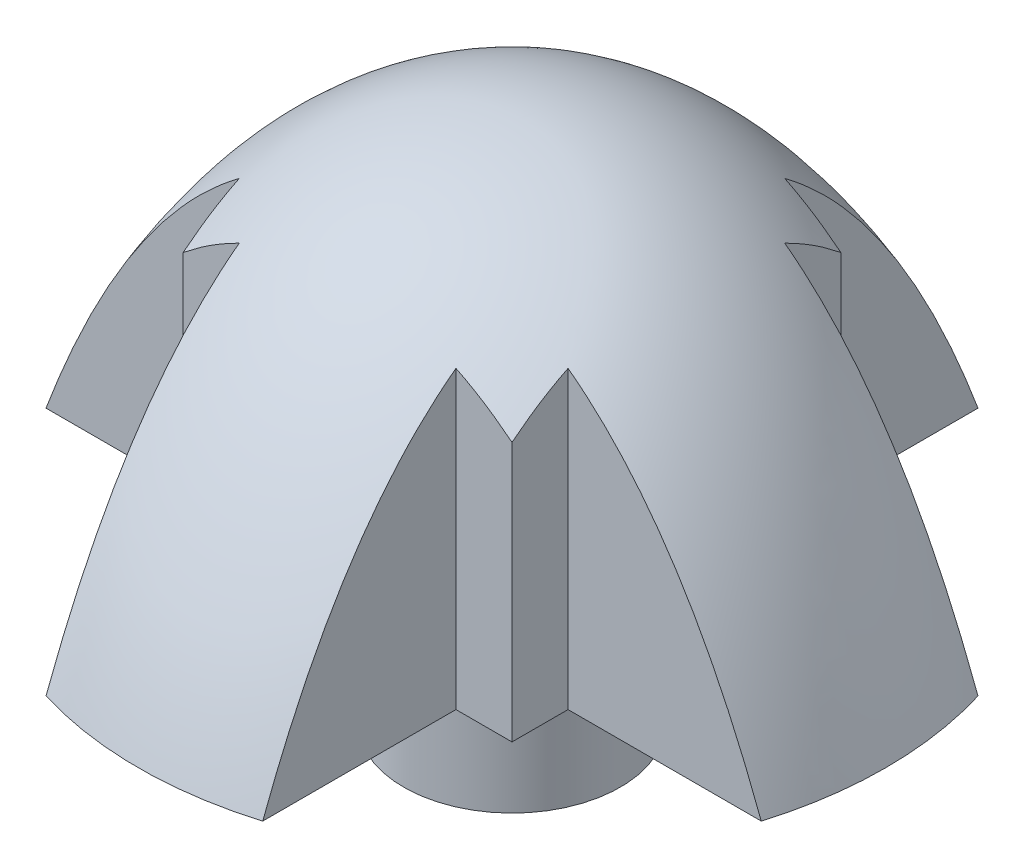
ISO-10303-21;
HEADER;
FILE_DESCRIPTION(('STEP AP214'),'2;1');
FILE_NAME('part.step','',(''),(''),'','','');
FILE_SCHEMA(('AUTOMOTIVE_DESIGN { 1 0 10303 214 1 1 1 1 }'));
ENDSEC;
DATA;
#1=APPLICATION_CONTEXT('core data for automotive mechanical design processes');
#2=APPLICATION_PROTOCOL_DEFINITION('international standard','automotive_design',2000,#1);
#3=PRODUCT_CONTEXT('',#1,'mechanical');
#4=PRODUCT('Part','Part','',(#3));
#5=PRODUCT_RELATED_PRODUCT_CATEGORY('part','',(#4));
#6=PRODUCT_DEFINITION_FORMATION('','',#4);
#7=PRODUCT_DEFINITION_CONTEXT('part definition',#1,'design');
#8=PRODUCT_DEFINITION('design','',#6,#7);
#9=PRODUCT_DEFINITION_SHAPE('','',#8);
#10=(LENGTH_UNIT() NAMED_UNIT(*) SI_UNIT(.MILLI.,.METRE.));
#11=(NAMED_UNIT(*) PLANE_ANGLE_UNIT() SI_UNIT($,.RADIAN.));
#12=(NAMED_UNIT(*) SI_UNIT($,.STERADIAN.) SOLID_ANGLE_UNIT());
#13=UNCERTAINTY_MEASURE_WITH_UNIT(LENGTH_MEASURE(1.E-05),#10,'distance_accuracy_value','');
#14=(GEOMETRIC_REPRESENTATION_CONTEXT(3) GLOBAL_UNCERTAINTY_ASSIGNED_CONTEXT((#13)) GLOBAL_UNIT_ASSIGNED_CONTEXT((#10,
#11,#12)) REPRESENTATION_CONTEXT('',''));
#15=CARTESIAN_POINT('',(0.,0.,0.));
#16=DIRECTION('',(0.,0.,1.));
#17=DIRECTION('',(1.,0.,0.));
#18=AXIS2_PLACEMENT_3D('',#15,#16,#17);
#19=CARTESIAN_POINT('',(0.,0.,0.));
#20=DIRECTION('',(0.,-1.,0.));
#21=DIRECTION('',(1.,0.,0.));
#22=AXIS2_PLACEMENT_3D('',#19,#20,#21);
#23=PLANE('',#22);
#24=CARTESIAN_POINT('',(0.,0.,0.));
#25=DIRECTION('',(0.,1.,0.));
#26=DIRECTION('',(-1.,0.,0.));
#27=AXIS2_PLACEMENT_3D('',#24,#25,#26);
#28=CIRCLE('',#27,1.45);
#29=CARTESIAN_POINT('',(-1.45,0.,0.));
#30=VERTEX_POINT('',#29);
#31=EDGE_CURVE('E246',#30,#30,#28,.T.);
#32=ORIENTED_EDGE('',*,*,#31,.T.);
#33=EDGE_LOOP('',(#32));
#34=FACE_BOUND('',#33,.T.);
#35=DIRECTION('',(-1.,0.,0.));
#36=VECTOR('',#35,1.);
#37=CARTESIAN_POINT('',(0.,0.,-2.2));
#38=LINE('',#37,#36);
#39=CARTESIAN_POINT('',(-1.45,0.,-2.2));
#40=VERTEX_POINT('',#39);
#41=CARTESIAN_POINT('',(-2.2,0.,-2.2));
#42=VERTEX_POINT('',#41);
#43=EDGE_CURVE('E250',#40,#42,#38,.T.);
#44=ORIENTED_EDGE('',*,*,#43,.F.);
#45=DIRECTION('',(0.,0.,-1.));
#46=VECTOR('',#45,1.);
#47=CARTESIAN_POINT('',(-1.45,0.,0.));
#48=LINE('',#47,#46);
#49=CARTESIAN_POINT('',(-1.45,0.,-4.78513322698543));
#50=VERTEX_POINT('',#49);
#51=EDGE_CURVE('E253',#40,#50,#48,.T.);
#52=ORIENTED_EDGE('',*,*,#51,.T.);
#53=CARTESIAN_POINT('',(0.,0.,0.));
#54=DIRECTION('',(0.,1.,0.));
#55=DIRECTION('',(-1.,0.,0.));
#56=AXIS2_PLACEMENT_3D('',#53,#54,#55);
#57=CIRCLE('',#56,5.);
#58=CARTESIAN_POINT('',(1.45,0.,-4.78513322698543));
#59=VERTEX_POINT('',#58);
#60=EDGE_CURVE('E356',#59,#50,#57,.T.);
#61=ORIENTED_EDGE('',*,*,#60,.F.);
#62=DIRECTION('',(0.,0.,1.));
#63=VECTOR('',#62,1.);
#64=CARTESIAN_POINT('',(1.45,0.,0.));
#65=LINE('',#64,#63);
#66=CARTESIAN_POINT('',(1.45,0.,-2.2));
#67=VERTEX_POINT('',#66);
#68=EDGE_CURVE('E384',#59,#67,#65,.T.);
#69=ORIENTED_EDGE('',*,*,#68,.T.);
#70=DIRECTION('',(-1.,0.,0.));
#71=VECTOR('',#70,1.);
#72=CARTESIAN_POINT('',(0.,0.,-2.2));
#73=LINE('',#72,#71);
#74=CARTESIAN_POINT('',(2.2,0.,-2.2));
#75=VERTEX_POINT('',#74);
#76=EDGE_CURVE('E372',#75,#67,#73,.T.);
#77=ORIENTED_EDGE('',*,*,#76,.F.);
#78=DIRECTION('',(0.,0.,-1.));
#79=VECTOR('',#78,1.);
#80=CARTESIAN_POINT('',(2.2,0.,0.));
#81=LINE('',#80,#79);
#82=CARTESIAN_POINT('',(2.2,0.,-1.45));
#83=VERTEX_POINT('',#82);
#84=EDGE_CURVE('E369',#83,#75,#81,.T.);
#85=ORIENTED_EDGE('',*,*,#84,.F.);
#86=DIRECTION('',(1.,0.,0.));
#87=VECTOR('',#86,1.);
#88=CARTESIAN_POINT('',(0.,0.,-1.45));
#89=LINE('',#88,#87);
#90=CARTESIAN_POINT('',(4.78513322698543,0.,-1.45));
#91=VERTEX_POINT('',#90);
#92=EDGE_CURVE('E367',#83,#91,#89,.T.);
#93=ORIENTED_EDGE('',*,*,#92,.T.);
#94=CARTESIAN_POINT('',(4.78513322698543,0.,1.45));
#95=VERTEX_POINT('',#94);
#96=EDGE_CURVE('E47',#95,#91,#57,.T.);
#97=ORIENTED_EDGE('',*,*,#96,.F.);
#98=DIRECTION('',(1.,0.,0.));
#99=VECTOR('',#98,1.);
#100=CARTESIAN_POINT('',(0.,0.,1.45));
#101=LINE('',#100,#99);
#102=CARTESIAN_POINT('',(2.2,0.,1.45));
#103=VERTEX_POINT('',#102);
#104=EDGE_CURVE('E160',#103,#95,#101,.T.);
#105=ORIENTED_EDGE('',*,*,#104,.F.);
#106=DIRECTION('',(0.,0.,-1.));
#107=VECTOR('',#106,1.);
#108=CARTESIAN_POINT('',(2.2,0.,0.));
#109=LINE('',#108,#107);
#110=CARTESIAN_POINT('',(2.2,0.,2.2));
#111=VERTEX_POINT('',#110);
#112=EDGE_CURVE('E172',#111,#103,#109,.T.);
#113=ORIENTED_EDGE('',*,*,#112,.F.);
#114=DIRECTION('',(-1.,0.,0.));
#115=VECTOR('',#114,1.);
#116=CARTESIAN_POINT('',(0.,0.,2.2));
#117=LINE('',#116,#115);
#118=CARTESIAN_POINT('',(1.45,0.,2.2));
#119=VERTEX_POINT('',#118);
#120=EDGE_CURVE('E174',#111,#119,#117,.T.);
#121=ORIENTED_EDGE('',*,*,#120,.T.);
#122=DIRECTION('',(0.,0.,-1.));
#123=VECTOR('',#122,1.);
#124=CARTESIAN_POINT('',(1.45,0.,0.));
#125=LINE('',#124,#123);
#126=CARTESIAN_POINT('',(1.45,0.,4.78513322698543));
#127=VERTEX_POINT('',#126);
#128=EDGE_CURVE('E463',#127,#119,#125,.T.);
#129=ORIENTED_EDGE('',*,*,#128,.F.);
#130=CARTESIAN_POINT('',(-1.45,0.,4.78513322698543));
#131=VERTEX_POINT('',#130);
#132=EDGE_CURVE('E11',#131,#127,#57,.T.);
#133=ORIENTED_EDGE('',*,*,#132,.F.);
#134=DIRECTION('',(0.,0.,1.));
#135=VECTOR('',#134,1.);
#136=CARTESIAN_POINT('',(-1.45,0.,0.));
#137=LINE('',#136,#135);
#138=CARTESIAN_POINT('',(-1.45,0.,2.2));
#139=VERTEX_POINT('',#138);
#140=EDGE_CURVE('E447',#139,#131,#137,.T.);
#141=ORIENTED_EDGE('',*,*,#140,.F.);
#142=DIRECTION('',(-1.,0.,0.));
#143=VECTOR('',#142,1.);
#144=CARTESIAN_POINT('',(0.,0.,2.2));
#145=LINE('',#144,#143);
#146=CARTESIAN_POINT('',(-2.2,0.,2.2));
#147=VERTEX_POINT('',#146);
#148=EDGE_CURVE('E319',#139,#147,#145,.T.);
#149=ORIENTED_EDGE('',*,*,#148,.T.);
#150=DIRECTION('',(0.,0.,-1.));
#151=VECTOR('',#150,1.);
#152=CARTESIAN_POINT('',(-2.2,0.,0.));
#153=LINE('',#152,#151);
#154=CARTESIAN_POINT('',(-2.2,0.,1.45));
#155=VERTEX_POINT('',#154);
#156=EDGE_CURVE('E445',#147,#155,#153,.T.);
#157=ORIENTED_EDGE('',*,*,#156,.T.);
#158=DIRECTION('',(1.,0.,0.));
#159=VECTOR('',#158,1.);
#160=CARTESIAN_POINT('',(0.,0.,1.45));
#161=LINE('',#160,#159);
#162=CARTESIAN_POINT('',(-4.78513322698543,0.,1.45));
#163=VERTEX_POINT('',#162);
#164=EDGE_CURVE('E442',#163,#155,#161,.T.);
#165=ORIENTED_EDGE('',*,*,#164,.F.);
#166=CARTESIAN_POINT('',(-4.78513322698543,0.,-1.45));
#167=VERTEX_POINT('',#166);
#168=EDGE_CURVE('E42',#167,#163,#57,.T.);
#169=ORIENTED_EDGE('',*,*,#168,.F.);
#170=DIRECTION('',(1.,0.,0.));
#171=VECTOR('',#170,1.);
#172=CARTESIAN_POINT('',(0.,0.,-1.45));
#173=LINE('',#172,#171);
#174=CARTESIAN_POINT('',(-2.2,0.,-1.45));
#175=VERTEX_POINT('',#174);
#176=EDGE_CURVE('E259',#167,#175,#173,.T.);
#177=ORIENTED_EDGE('',*,*,#176,.T.);
#178=DIRECTION('',(0.,0.,-1.));
#179=VECTOR('',#178,1.);
#180=CARTESIAN_POINT('',(-2.2,0.,0.));
#181=LINE('',#180,#179);
#182=EDGE_CURVE('E257',#175,#42,#181,.T.);
#183=ORIENTED_EDGE('',*,*,#182,.T.);
#184=EDGE_LOOP('',(#44,#52,#61,#69,#77,#85,#93,#97,#105,#113,#121,#129,#133,#141,#149,#157,#165,
#169,#177,#183));
#185=FACE_BOUND('',#184,.T.);
#186=ADVANCED_FACE('F39',(#34,#185),#23,.T.);
#187=CARTESIAN_POINT('',(5.,0.,0.));
#188=CARTESIAN_POINT('',(3.20156211871642,5.,0.));
#189=CARTESIAN_POINT('',(0.,5.,0.));
#190=B_SPLINE_CURVE_WITH_KNOTS('',2,(#187,#188,#189),.UNSPECIFIED.,.F.,.F.,(3,3),(0.,1.),.UNSPECIFIED.);
#191=CARTESIAN_POINT('',(0.,5.,0.));
#192=DIRECTION('',(0.,1.,0.));
#193=AXIS1_PLACEMENT('',#191,#192);
#194=SURFACE_OF_REVOLUTION('',#190,#193);
#195=CARTESIAN_POINT('',(0.,5.,0.));
#196=VERTEX_POINT('',#195);
#197=VERTEX_LOOP('',#196);
#198=FACE_BOUND('',#197,.T.);
#199=CARTESIAN_POINT('',(-1.45,0.,-4.78513322698543));
#200=CARTESIAN_POINT('',(-1.45,0.165279522424048,-4.72298822809541));
#201=CARTESIAN_POINT('',(-1.45,0.3296633173417,-4.65838739887485));
#202=CARTESIAN_POINT('',(-1.45,0.657336142604421,-4.52308483720879));
#203=CARTESIAN_POINT('',(-1.45,0.820607780613359,-4.45234107555361));
#204=CARTESIAN_POINT('',(-1.45,1.17324484552827,-4.29123187190407));
#205=CARTESIAN_POINT('',(-1.45,1.36204693184629,-4.19962133375261));
#206=CARTESIAN_POINT('',(-1.45,1.73440952835101,-4.00609918855239));
#207=CARTESIAN_POINT('',(-1.45,1.91796838743862,-3.90418438155586));
#208=CARTESIAN_POINT('',(-1.45,2.2769178364414,-3.68906496293644));
#209=CARTESIAN_POINT('',(-1.45,2.45235093386886,-3.57593198159752));
#210=CARTESIAN_POINT('',(-1.45,2.79360196374047,-3.336109327388));
#211=CARTESIAN_POINT('',(-1.45,2.95942654789283,-3.20942920996381));
#212=CARTESIAN_POINT('',(-1.45,3.27267494271116,-2.94507527282747));
#213=CARTESIAN_POINT('',(-1.45,3.42053468836853,-2.80792723733193));
#214=CARTESIAN_POINT('',(-1.45,3.63041479359818,-2.5898360237992));
#215=CARTESIAN_POINT('',(-1.45,3.69860141929146,-2.5148007234452));
#216=CARTESIAN_POINT('',(-1.45,3.83019587971611,-2.36055042643897));
#217=CARTESIAN_POINT('',(-1.45,3.89359970412175,-2.28133201485439));
#218=CARTESIAN_POINT('',(-1.45,3.95425879443475,-2.2));
#219=B_SPLINE_CURVE_WITH_KNOTS('',3,(#199,#200,#201,#202,#203,#204,#205,#206,#207,#208,#209,
#210,#211,#212,#213,#214,#215,#216,#217,#218),.UNSPECIFIED.,.F.,.F.,(4,2,2,2,2,2,2,2,2,4),(0.,
0.529747072658857,1.0634575712593,1.69274746096572,2.3222333777891,2.94793118616491,
3.57319053493948,4.17701421508037,4.48100230954553,4.78524252493984),.UNSPECIFIED.);
#220=CARTESIAN_POINT('',(-1.45,3.95425879443475,-2.2));
#221=VERTEX_POINT('',#220);
#222=EDGE_CURVE('E261',#50,#221,#219,.T.);
#223=ORIENTED_EDGE('',*,*,#222,.T.);
#224=CARTESIAN_POINT('',(-2.2,3.47160448112221,-2.2));
#225=CARTESIAN_POINT('',(-2.16125658034658,3.50282481120708,-2.2));
#226=CARTESIAN_POINT('',(-2.12200075284266,3.5334135106388,-2.2));
#227=CARTESIAN_POINT('',(-2.04257351458628,3.59315502023765,-2.2));
#228=CARTESIAN_POINT('',(-2.00240478593111,3.62231139815114,-2.2));
#229=CARTESIAN_POINT('',(-1.92111510488297,3.67914032402243,-2.2));
#230=CARTESIAN_POINT('',(-1.87999559597448,3.70681493379356,-2.2));
#231=CARTESIAN_POINT('',(-1.79675773696518,3.76063337347338,-2.2));
#232=CARTESIAN_POINT('',(-1.75463924766799,3.78677698827405,-2.2));
#233=CARTESIAN_POINT('',(-1.66937601412481,3.8374656598117,-2.2));
#234=CARTESIAN_POINT('',(-1.62623001477836,3.86200860850462,-2.20000000000001));
#235=CARTESIAN_POINT('',(-1.53887606175923,3.90943008267902,-2.19999999999999));
#236=CARTESIAN_POINT('',(-1.49466546165566,3.93230373068424,-2.19999999999998));
#237=CARTESIAN_POINT('',(-1.45000000000001,3.95425879443477,-2.19999999999994));
#238=B_SPLINE_CURVE_WITH_KNOTS('',3,(#224,#225,#226,#227,#228,#229,#230,#231,#232,#233,#234,
#235,#236,#237),.UNSPECIFIED.,.F.,.F.,(4,2,2,2,2,2,4),(0.,0.149268368816899,0.298143818009002,
0.446806422255339,0.595489864042523,0.744365321525828,0.893659668595505),.UNSPECIFIED.);
#239=CARTESIAN_POINT('',(-2.2,3.47160448112221,-2.2));
#240=VERTEX_POINT('',#239);
#241=EDGE_CURVE('E395',#240,#221,#238,.T.);
#242=ORIENTED_EDGE('',*,*,#241,.F.);
#243=CARTESIAN_POINT('',(-2.2,3.47160448112221,-2.2));
#244=CARTESIAN_POINT('',(-2.2,3.50282481120708,-2.16125658034658));
#245=CARTESIAN_POINT('',(-2.2,3.5334135106388,-2.12200075284266));
#246=CARTESIAN_POINT('',(-2.2,3.59315502023765,-2.04257351458628));
#247=CARTESIAN_POINT('',(-2.2,3.62231139815114,-2.00240478593111));
#248=CARTESIAN_POINT('',(-2.2,3.67914032402243,-1.92111510488297));
#249=CARTESIAN_POINT('',(-2.2,3.70681493379356,-1.87999559597448));
#250=CARTESIAN_POINT('',(-2.2,3.76063337347338,-1.79675773696518));
#251=CARTESIAN_POINT('',(-2.2,3.78677698827405,-1.75463924766799));
#252=CARTESIAN_POINT('',(-2.2,3.8374656598117,-1.66937601412481));
#253=CARTESIAN_POINT('',(-2.20000000000001,3.86200860850462,-1.62623001477836));
#254=CARTESIAN_POINT('',(-2.19999999999999,3.90943008267902,-1.53887606175923));
#255=CARTESIAN_POINT('',(-2.19999999999998,3.93230373068424,-1.49466546165565));
#256=CARTESIAN_POINT('',(-2.19999999999994,3.95425879443477,-1.45000000000001));
#257=B_SPLINE_CURVE_WITH_KNOTS('',3,(#243,#244,#245,#246,#247,#248,#249,#250,#251,#252,#253,
#254,#255,#256),.UNSPECIFIED.,.F.,.F.,(4,2,2,2,2,2,4),(0.,0.1492683688169,0.298143818009003,
0.446806422255341,0.595489864042524,0.744365321525829,0.893659668595508),.UNSPECIFIED.);
#258=CARTESIAN_POINT('',(-2.2,3.95425879443475,-1.45));
#259=VERTEX_POINT('',#258);
#260=EDGE_CURVE('E415',#240,#259,#257,.T.);
#261=ORIENTED_EDGE('',*,*,#260,.T.);
#262=CARTESIAN_POINT('',(-2.2,3.95425879443475,-1.45));
#263=CARTESIAN_POINT('',(-2.30644824417588,3.87486519803898,-1.45));
#264=CARTESIAN_POINT('',(-2.40925006606346,3.79079528118082,-1.45));
#265=CARTESIAN_POINT('',(-2.6074043863576,3.615102644341,-1.45));
#266=CARTESIAN_POINT('',(-2.70278745560588,3.52351451090856,-1.45));
#267=CARTESIAN_POINT('',(-2.93420937433464,3.28509990024499,-1.45));
#268=CARTESIAN_POINT('',(-3.06592865707188,3.13408953346185,-1.45));
#269=CARTESIAN_POINT('',(-3.31565075273556,2.82102374786098,-1.45));
#270=CARTESIAN_POINT('',(-3.43363884214412,2.65895676333218,-1.45));
#271=CARTESIAN_POINT('',(-3.65834795433047,2.32543761558953,-1.45));
#272=CARTESIAN_POINT('',(-3.76497519370864,2.15392277888082,-1.45));
#273=CARTESIAN_POINT('',(-3.96749786461329,1.80481785761545,-1.45));
#274=CARTESIAN_POINT('',(-4.06339734393325,1.6272300977408,-1.45));
#275=CARTESIAN_POINT('',(-4.2745592052948,1.21102443479132,-1.45));
#276=CARTESIAN_POINT('',(-4.38647836147422,0.970712844485089,-1.45));
#277=CARTESIAN_POINT('',(-4.54371248632612,0.607571956561483,-1.45));
#278=CARTESIAN_POINT('',(-4.5940569114471,0.486870642769183,-1.45));
#279=CARTESIAN_POINT('',(-4.69176340054821,0.244284185732435,-1.45));
#280=CARTESIAN_POINT('',(-4.73912586009953,0.122399201993636,-1.45));
#281=CARTESIAN_POINT('',(-4.78513322698543,0.,-1.45));
#282=B_SPLINE_CURVE_WITH_KNOTS('',3,(#262,#263,#264,#265,#266,#267,#268,#269,#270,#271,#272,
#273,#274,#275,#276,#277,#278,#279,#280,#281),.UNSPECIFIED.,.F.,.F.,(4,2,2,2,2,2,2,2,2,4),(0.,
0.398061189509696,0.794384036834537,1.39453285793083,1.99531938302931,2.60073340948475,
3.20591822535105,4.00065436522981,4.39296590731435,4.7852252973733),.UNSPECIFIED.);
#283=EDGE_CURVE('E421',#259,#167,#282,.T.);
#284=ORIENTED_EDGE('',*,*,#283,.T.);
#285=ORIENTED_EDGE('',*,*,#168,.T.);
#286=CARTESIAN_POINT('',(-2.2,3.95425879443476,1.45));
#287=CARTESIAN_POINT('',(-2.30644824417588,3.87486519803898,1.45));
#288=CARTESIAN_POINT('',(-2.40925006606346,3.79079528118082,1.45));
#289=CARTESIAN_POINT('',(-2.6074043863576,3.615102644341,1.45));
#290=CARTESIAN_POINT('',(-2.70278745560587,3.52351451090856,1.45));
#291=CARTESIAN_POINT('',(-2.93420937433464,3.285099900245,1.45));
#292=CARTESIAN_POINT('',(-3.06592865707188,3.13408953346185,1.45));
#293=CARTESIAN_POINT('',(-3.31565075273555,2.82102374786098,1.45));
#294=CARTESIAN_POINT('',(-3.43363884214411,2.65895676333219,1.45));
#295=CARTESIAN_POINT('',(-3.65834795433047,2.32543761558954,1.45));
#296=CARTESIAN_POINT('',(-3.76497519370864,2.15392277888083,1.45));
#297=CARTESIAN_POINT('',(-3.96749786461329,1.80481785761546,1.45));
#298=CARTESIAN_POINT('',(-4.06339734393325,1.62723009774081,1.45));
#299=CARTESIAN_POINT('',(-4.2745592052948,1.21102443479133,1.45));
#300=CARTESIAN_POINT('',(-4.38647836147422,0.970712844485095,1.45));
#301=CARTESIAN_POINT('',(-4.54371248632612,0.607571956561488,1.45));
#302=CARTESIAN_POINT('',(-4.5940569114471,0.486870642769186,1.45));
#303=CARTESIAN_POINT('',(-4.69176340054821,0.244284185732436,1.45));
#304=CARTESIAN_POINT('',(-4.73912586009953,0.122399201993636,1.45));
#305=CARTESIAN_POINT('',(-4.78513322698543,0.,1.45));
#306=B_SPLINE_CURVE_WITH_KNOTS('',3,(#286,#287,#288,#289,#290,#291,#292,#293,#294,#295,#296,
#297,#298,#299,#300,#301,#302,#303,#304,#305),.UNSPECIFIED.,.F.,.F.,(4,2,2,2,2,2,2,2,2,4),(0.,
0.398061189509697,0.794384036834537,1.39453285793083,1.99531938302931,2.60073340948475,
3.20591822535104,4.00065436522981,4.39296590731435,4.78522529737331),.UNSPECIFIED.);
#307=CARTESIAN_POINT('',(-2.2,3.95425879443476,1.45));
#308=VERTEX_POINT('',#307);
#309=EDGE_CURVE('E313',#308,#163,#306,.T.);
#310=ORIENTED_EDGE('',*,*,#309,.F.);
#311=CARTESIAN_POINT('',(-2.2,3.95425879443476,1.45));
#312=CARTESIAN_POINT('',(-2.2,3.89555391766606,1.56951371643312));
#313=CARTESIAN_POINT('',(-2.2,3.83024943192226,1.6856780188532));
#314=CARTESIAN_POINT('',(-2.2,3.68871463695129,1.91034704703472));
#315=CARTESIAN_POINT('',(-2.2,3.61254184901962,2.01888787162039));
#316=CARTESIAN_POINT('',(-2.2,3.52184428493977,2.13654892964888));
#317=CARTESIAN_POINT('',(-2.2,3.51189581083861,2.14930971172493));
#318=CARTESIAN_POINT('',(-2.2,3.49185564357018,2.17473130287635));
#319=CARTESIAN_POINT('',(-2.2,3.48176386449149,2.18739204423063));
#320=CARTESIAN_POINT('',(-2.2,3.47160448112221,2.2));
#321=B_SPLINE_CURVE_WITH_KNOTS('',3,(#311,#312,#313,#314,#315,#316,#317,#318,#319,#320),
.UNSPECIFIED.,.F.,.F.,(4,2,2,2,4),(0.,0.399151166371817,0.796263183280432,0.844805190429391,
0.893377642365074),.UNSPECIFIED.);
#322=CARTESIAN_POINT('',(-2.2,3.47160448112221,2.2));
#323=VERTEX_POINT('',#322);
#324=EDGE_CURVE('E307',#308,#323,#321,.T.);
#325=ORIENTED_EDGE('',*,*,#324,.T.);
#326=CARTESIAN_POINT('',(-2.2,3.47160448112221,2.2));
#327=CARTESIAN_POINT('',(-2.16125658034658,3.50282481120708,2.2));
#328=CARTESIAN_POINT('',(-2.12200075284266,3.5334135106388,2.2));
#329=CARTESIAN_POINT('',(-2.04257351458628,3.59315502023765,2.2));
#330=CARTESIAN_POINT('',(-2.00240478593111,3.62231139815114,2.2));
#331=CARTESIAN_POINT('',(-1.92111510488297,3.67914032402243,2.2));
#332=CARTESIAN_POINT('',(-1.87999559597448,3.70681493379356,2.2));
#333=CARTESIAN_POINT('',(-1.79675773696518,3.76063337347338,2.2));
#334=CARTESIAN_POINT('',(-1.75463924766799,3.78677698827405,2.2));
#335=CARTESIAN_POINT('',(-1.66937601412481,3.8374656598117,2.2));
#336=CARTESIAN_POINT('',(-1.62623001477836,3.86200860850462,2.20000000000001));
#337=CARTESIAN_POINT('',(-1.53887606175923,3.90943008267902,2.19999999999999));
#338=CARTESIAN_POINT('',(-1.49466546165565,3.93230373068424,2.19999999999998));
#339=CARTESIAN_POINT('',(-1.45000000000001,3.95425879443477,2.19999999999994));
#340=B_SPLINE_CURVE_WITH_KNOTS('',3,(#326,#327,#328,#329,#330,#331,#332,#333,#334,#335,#336,
#337,#338,#339),.UNSPECIFIED.,.F.,.F.,(4,2,2,2,2,2,4),(0.,0.1492683688169,0.298143818009002,
0.446806422255339,0.595489864042523,0.744365321525827,0.893659668595505),.UNSPECIFIED.);
#341=CARTESIAN_POINT('',(-1.45,3.95425879443475,2.2));
#342=VERTEX_POINT('',#341);
#343=EDGE_CURVE('E300',#323,#342,#340,.T.);
#344=ORIENTED_EDGE('',*,*,#343,.T.);
#345=CARTESIAN_POINT('',(-1.45,0.,4.78513322698543));
#346=CARTESIAN_POINT('',(-1.45,0.165279522424049,4.72298822809541));
#347=CARTESIAN_POINT('',(-1.45,0.3296633173417,4.65838739887485));
#348=CARTESIAN_POINT('',(-1.45,0.657336142604421,4.52308483720879));
#349=CARTESIAN_POINT('',(-1.45,0.820607780613359,4.45234107555361));
#350=CARTESIAN_POINT('',(-1.45,1.17324484552827,4.29123187190407));
#351=CARTESIAN_POINT('',(-1.45,1.36204693184629,4.19962133375261));
#352=CARTESIAN_POINT('',(-1.45,1.73440952835102,4.00609918855239));
#353=CARTESIAN_POINT('',(-1.45,1.91796838743863,3.90418438155585));
#354=CARTESIAN_POINT('',(-1.45,2.2769178364414,3.68906496293644));
#355=CARTESIAN_POINT('',(-1.45,2.45235093386887,3.57593198159752));
#356=CARTESIAN_POINT('',(-1.45,2.79360196374047,3.33610932738799));
#357=CARTESIAN_POINT('',(-1.45,2.95942654789283,3.20942920996381));
#358=CARTESIAN_POINT('',(-1.45,3.27267494271116,2.94507527282747));
#359=CARTESIAN_POINT('',(-1.45,3.42053468836854,2.80792723733193));
#360=CARTESIAN_POINT('',(-1.45,3.63041479359818,2.5898360237992));
#361=CARTESIAN_POINT('',(-1.45,3.69860141929146,2.5148007234452));
#362=CARTESIAN_POINT('',(-1.45,3.83019587971611,2.36055042643897));
#363=CARTESIAN_POINT('',(-1.45,3.89359970412175,2.28133201485439));
#364=CARTESIAN_POINT('',(-1.45,3.95425879443475,2.2));
#365=B_SPLINE_CURVE_WITH_KNOTS('',3,(#345,#346,#347,#348,#349,#350,#351,#352,#353,#354,#355,
#356,#357,#358,#359,#360,#361,#362,#363,#364),.UNSPECIFIED.,.F.,.F.,(4,2,2,2,2,2,2,2,2,4),(0.,
0.529747072658857,1.0634575712593,1.69274746096572,2.3222333777891,2.94793118616491,
3.57319053493949,4.17701421508037,4.48100230954553,4.78524252493984),.UNSPECIFIED.);
#366=EDGE_CURVE('E276',#131,#342,#365,.T.);
#367=ORIENTED_EDGE('',*,*,#366,.F.);
#368=ORIENTED_EDGE('',*,*,#132,.T.);
#369=CARTESIAN_POINT('',(1.45,3.95425879443475,2.2));
#370=CARTESIAN_POINT('',(1.45,3.87486519803897,2.30644824417588));
#371=CARTESIAN_POINT('',(1.45,3.79079528118082,2.40925006606346));
#372=CARTESIAN_POINT('',(1.45,3.615102644341,2.60740438635761));
#373=CARTESIAN_POINT('',(1.45,3.52351451090856,2.70278745560588));
#374=CARTESIAN_POINT('',(1.45,3.28509990024499,2.93420937433464));
#375=CARTESIAN_POINT('',(1.45,3.13408953346185,3.06592865707188));
#376=CARTESIAN_POINT('',(1.45,2.82102374786098,3.31565075273556));
#377=CARTESIAN_POINT('',(1.45,2.65895676333218,3.43363884214412));
#378=CARTESIAN_POINT('',(1.45,2.32543761558953,3.65834795433047));
#379=CARTESIAN_POINT('',(1.45,2.15392277888083,3.76497519370864));
#380=CARTESIAN_POINT('',(1.45,1.80481785761545,3.9674978646133));
#381=CARTESIAN_POINT('',(1.45,1.6272300977408,4.06339734393325));
#382=CARTESIAN_POINT('',(1.45,1.21102443479132,4.2745592052948));
#383=CARTESIAN_POINT('',(1.45,0.97071284448509,4.38647836147422));
#384=CARTESIAN_POINT('',(1.45,0.607571956561484,4.54371248632612));
#385=CARTESIAN_POINT('',(1.45,0.486870642769184,4.5940569114471));
#386=CARTESIAN_POINT('',(1.45,0.244284185732436,4.69176340054821));
#387=CARTESIAN_POINT('',(1.45,0.122399201993637,4.73912586009953));
#388=CARTESIAN_POINT('',(1.45,0.,4.78513322698543));
#389=B_SPLINE_CURVE_WITH_KNOTS('',3,(#369,#370,#371,#372,#373,#374,#375,#376,#377,#378,#379,
#380,#381,#382,#383,#384,#385,#386,#387,#388),.UNSPECIFIED.,.F.,.F.,(4,2,2,2,2,2,2,2,2,4),(0.,
0.398061189509696,0.794384036834537,1.39453285793083,1.99531938302931,2.60073340948475,
3.20591822535104,4.00065436522981,4.39296590731434,4.7852252973733),.UNSPECIFIED.);
#390=CARTESIAN_POINT('',(1.45,3.95425879443475,2.2));
#391=VERTEX_POINT('',#390);
#392=EDGE_CURVE('E182',#391,#127,#389,.T.);
#393=ORIENTED_EDGE('',*,*,#392,.F.);
#394=CARTESIAN_POINT('',(1.45,3.95425879443475,2.2));
#395=CARTESIAN_POINT('',(1.56951371643313,3.89555391766606,2.19999999999999));
#396=CARTESIAN_POINT('',(1.68567801885321,3.83024943192226,2.2));
#397=CARTESIAN_POINT('',(1.91034704703472,3.68871463695128,2.2));
#398=CARTESIAN_POINT('',(2.01888787162039,3.61254184901961,2.20000000000001));
#399=CARTESIAN_POINT('',(2.13654892964888,3.52184428493977,2.2));
#400=CARTESIAN_POINT('',(2.14930971172494,3.51189581083861,2.2));
#401=CARTESIAN_POINT('',(2.17473130287635,3.49185564357018,2.2));
#402=CARTESIAN_POINT('',(2.18739204423063,3.48176386449149,2.2));
#403=CARTESIAN_POINT('',(2.2,3.47160448112221,2.2));
#404=B_SPLINE_CURVE_WITH_KNOTS('',3,(#394,#395,#396,#397,#398,#399,#400,#401,#402,#403),
.UNSPECIFIED.,.F.,.F.,(4,2,2,2,4),(0.,0.399151166371817,0.796263183280433,0.844805190429386,
0.893377642365066),.UNSPECIFIED.);
#405=CARTESIAN_POINT('',(2.2,3.47160448112221,2.2));
#406=VERTEX_POINT('',#405);
#407=EDGE_CURVE('E180',#391,#406,#404,.T.);
#408=ORIENTED_EDGE('',*,*,#407,.T.);
#409=CARTESIAN_POINT('',(2.2,3.95425879443475,1.45));
#410=CARTESIAN_POINT('',(2.2,3.89555391766606,1.56951371643312));
#411=CARTESIAN_POINT('',(2.2,3.83024943192226,1.6856780188532));
#412=CARTESIAN_POINT('',(2.2,3.68871463695128,1.91034704703472));
#413=CARTESIAN_POINT('',(2.2,3.61254184901961,2.01888787162039));
#414=CARTESIAN_POINT('',(2.2,3.52184428493977,2.13654892964888));
#415=CARTESIAN_POINT('',(2.2,3.51189581083861,2.14930971172493));
#416=CARTESIAN_POINT('',(2.2,3.49185564357018,2.17473130287635));
#417=CARTESIAN_POINT('',(2.2,3.48176386449149,2.18739204423063));
#418=CARTESIAN_POINT('',(2.2,3.47160448112221,2.2));
#419=B_SPLINE_CURVE_WITH_KNOTS('',3,(#409,#410,#411,#412,#413,#414,#415,#416,#417,#418),
.UNSPECIFIED.,.F.,.F.,(4,2,2,2,4),(0.,0.399151166371817,0.796263183280433,0.844805190429388,
0.893377642365069),.UNSPECIFIED.);
#420=CARTESIAN_POINT('',(2.2,3.95425879443475,1.45));
#421=VERTEX_POINT('',#420);
#422=EDGE_CURVE('E165',#421,#406,#419,.T.);
#423=ORIENTED_EDGE('',*,*,#422,.F.);
#424=CARTESIAN_POINT('',(4.78513322698543,0.,1.45));
#425=CARTESIAN_POINT('',(4.72298822809541,0.165279522424051,1.45));
#426=CARTESIAN_POINT('',(4.65838739887485,0.329663317341703,1.45));
#427=CARTESIAN_POINT('',(4.52308483720879,0.657336142604424,1.45));
#428=CARTESIAN_POINT('',(4.45234107555361,0.820607780613362,1.45));
#429=CARTESIAN_POINT('',(4.29123187190407,1.17324484552827,1.45));
#430=CARTESIAN_POINT('',(4.19962133375261,1.36204693184629,1.45));
#431=CARTESIAN_POINT('',(4.00609918855239,1.73440952835102,1.45));
#432=CARTESIAN_POINT('',(3.90418438155585,1.91796838743863,1.45));
#433=CARTESIAN_POINT('',(3.68906496293644,2.2769178364414,1.45));
#434=CARTESIAN_POINT('',(3.57593198159752,2.45235093386887,1.45));
#435=CARTESIAN_POINT('',(3.33610932738799,2.79360196374047,1.45));
#436=CARTESIAN_POINT('',(3.20942920996381,2.95942654789283,1.45));
#437=CARTESIAN_POINT('',(2.94507527282747,3.27267494271116,1.45));
#438=CARTESIAN_POINT('',(2.80792723733193,3.42053468836854,1.45));
#439=CARTESIAN_POINT('',(2.5898360237992,3.63041479359818,1.45));
#440=CARTESIAN_POINT('',(2.5148007234452,3.69860141929146,1.45));
#441=CARTESIAN_POINT('',(2.36055042643896,3.83019587971611,1.45));
#442=CARTESIAN_POINT('',(2.28133201485439,3.89359970412175,1.45));
#443=CARTESIAN_POINT('',(2.2,3.95425879443475,1.45));
#444=B_SPLINE_CURVE_WITH_KNOTS('',3,(#424,#425,#426,#427,#428,#429,#430,#431,#432,#433,#434,
#435,#436,#437,#438,#439,#440,#441,#442,#443),.UNSPECIFIED.,.F.,.F.,(4,2,2,2,2,2,2,2,2,4),(0.,
0.529747072658857,1.0634575712593,1.69274746096572,2.3222333777891,2.94793118616491,
3.57319053493948,4.17701421508037,4.48100230954553,4.78524252493984),.UNSPECIFIED.);
#445=EDGE_CURVE('E154',#95,#421,#444,.T.);
#446=ORIENTED_EDGE('',*,*,#445,.F.);
#447=ORIENTED_EDGE('',*,*,#96,.T.);
#448=CARTESIAN_POINT('',(4.78513322698543,0.,-1.45));
#449=CARTESIAN_POINT('',(4.7229882280954,0.16527952242405,-1.45));
#450=CARTESIAN_POINT('',(4.65838739887485,0.329663317341702,-1.45));
#451=CARTESIAN_POINT('',(4.52308483720879,0.657336142604422,-1.45));
#452=CARTESIAN_POINT('',(4.45234107555361,0.820607780613361,-1.45));
#453=CARTESIAN_POINT('',(4.29123187190407,1.17324484552827,-1.45));
#454=CARTESIAN_POINT('',(4.19962133375261,1.36204693184629,-1.45));
#455=CARTESIAN_POINT('',(4.00609918855239,1.73440952835102,-1.45));
#456=CARTESIAN_POINT('',(3.90418438155585,1.91796838743862,-1.45));
#457=CARTESIAN_POINT('',(3.68906496293644,2.2769178364414,-1.45));
#458=CARTESIAN_POINT('',(3.57593198159752,2.45235093386886,-1.45));
#459=CARTESIAN_POINT('',(3.336109327388,2.79360196374047,-1.45));
#460=CARTESIAN_POINT('',(3.20942920996381,2.95942654789283,-1.45));
#461=CARTESIAN_POINT('',(2.94507527282747,3.27267494271116,-1.45));
#462=CARTESIAN_POINT('',(2.80792723733193,3.42053468836854,-1.45));
#463=CARTESIAN_POINT('',(2.5898360237992,3.63041479359818,-1.45));
#464=CARTESIAN_POINT('',(2.5148007234452,3.69860141929146,-1.45));
#465=CARTESIAN_POINT('',(2.36055042643896,3.83019587971611,-1.45));
#466=CARTESIAN_POINT('',(2.28133201485439,3.89359970412175,-1.45));
#467=CARTESIAN_POINT('',(2.19999999999999,3.95425879443475,-1.45));
#468=B_SPLINE_CURVE_WITH_KNOTS('',3,(#448,#449,#450,#451,#452,#453,#454,#455,#456,#457,#458,
#459,#460,#461,#462,#463,#464,#465,#466,#467),.UNSPECIFIED.,.F.,.F.,(4,2,2,2,2,2,2,2,2,4),(0.,
0.529747072658857,1.0634575712593,1.69274746096572,2.3222333777891,2.94793118616491,
3.57319053493948,4.17701421508037,4.48100230954553,4.78524252493984),.UNSPECIFIED.);
#469=CARTESIAN_POINT('',(2.2,3.95425879443476,-1.45));
#470=VERTEX_POINT('',#469);
#471=EDGE_CURVE('E363',#91,#470,#468,.T.);
#472=ORIENTED_EDGE('',*,*,#471,.T.);
#473=CARTESIAN_POINT('',(2.2,3.47160448112221,-2.2));
#474=CARTESIAN_POINT('',(2.2,3.50282481120708,-2.16125658034658));
#475=CARTESIAN_POINT('',(2.2,3.5334135106388,-2.12200075284266));
#476=CARTESIAN_POINT('',(2.2,3.59315502023765,-2.04257351458628));
#477=CARTESIAN_POINT('',(2.2,3.62231139815114,-2.00240478593111));
#478=CARTESIAN_POINT('',(2.2,3.67914032402243,-1.92111510488297));
#479=CARTESIAN_POINT('',(2.2,3.70681493379356,-1.87999559597448));
#480=CARTESIAN_POINT('',(2.2,3.76063337347338,-1.79675773696518));
#481=CARTESIAN_POINT('',(2.2,3.78677698827405,-1.75463924766799));
#482=CARTESIAN_POINT('',(2.2,3.8374656598117,-1.6693760141248));
#483=CARTESIAN_POINT('',(2.20000000000001,3.86200860850463,-1.62623001477835));
#484=CARTESIAN_POINT('',(2.19999999999999,3.90943008267902,-1.53887606175923));
#485=CARTESIAN_POINT('',(2.19999999999998,3.93230373068424,-1.49466546165565));
#486=CARTESIAN_POINT('',(2.19999999999994,3.95425879443477,-1.45));
#487=B_SPLINE_CURVE_WITH_KNOTS('',3,(#473,#474,#475,#476,#477,#478,#479,#480,#481,#482,#483,
#484,#485,#486),.UNSPECIFIED.,.F.,.F.,(4,2,2,2,2,2,4),(0.,0.1492683688169,0.298143818009004,
0.446806422255343,0.595489864042527,0.744365321525833,0.893659668595512),.UNSPECIFIED.);
#488=CARTESIAN_POINT('',(2.2,3.47160448112221,-2.2));
#489=VERTEX_POINT('',#488);
#490=EDGE_CURVE('E269',#489,#470,#487,.T.);
#491=ORIENTED_EDGE('',*,*,#490,.F.);
#492=CARTESIAN_POINT('',(1.45,3.95425879443475,-2.2));
#493=CARTESIAN_POINT('',(1.56951371643313,3.89555391766606,-2.20000000000001));
#494=CARTESIAN_POINT('',(1.6856780188532,3.83024943192226,-2.2));
#495=CARTESIAN_POINT('',(1.91034704703472,3.68871463695128,-2.2));
#496=CARTESIAN_POINT('',(2.01888787162039,3.61254184901961,-2.19999999999999));
#497=CARTESIAN_POINT('',(2.13654892964888,3.52184428493977,-2.2));
#498=CARTESIAN_POINT('',(2.14930971172493,3.51189581083861,-2.2));
#499=CARTESIAN_POINT('',(2.17473130287635,3.49185564357018,-2.2));
#500=CARTESIAN_POINT('',(2.18739204423063,3.48176386449149,-2.2));
#501=CARTESIAN_POINT('',(2.2,3.47160448112221,-2.2));
#502=B_SPLINE_CURVE_WITH_KNOTS('',3,(#492,#493,#494,#495,#496,#497,#498,#499,#500,#501),
.UNSPECIFIED.,.F.,.F.,(4,2,2,2,4),(0.,0.399151166371817,0.796263183280432,0.844805190429386,
0.893377642365067),.UNSPECIFIED.);
#503=CARTESIAN_POINT('',(1.45,3.95425879443475,-2.2));
#504=VERTEX_POINT('',#503);
#505=EDGE_CURVE('E490',#504,#489,#502,.T.);
#506=ORIENTED_EDGE('',*,*,#505,.F.);
#507=CARTESIAN_POINT('',(1.45,3.95425879443475,-2.2));
#508=CARTESIAN_POINT('',(1.45,3.87486519803897,-2.30644824417588));
#509=CARTESIAN_POINT('',(1.45,3.79079528118082,-2.40925006606346));
#510=CARTESIAN_POINT('',(1.45,3.615102644341,-2.60740438635761));
#511=CARTESIAN_POINT('',(1.45,3.52351451090856,-2.70278745560588));
#512=CARTESIAN_POINT('',(1.45,3.28509990024499,-2.93420937433465));
#513=CARTESIAN_POINT('',(1.45,3.13408953346185,-3.06592865707188));
#514=CARTESIAN_POINT('',(1.45,2.82102374786098,-3.31565075273556));
#515=CARTESIAN_POINT('',(1.45,2.65895676333218,-3.43363884214412));
#516=CARTESIAN_POINT('',(1.45,2.32543761558953,-3.65834795433047));
#517=CARTESIAN_POINT('',(1.45,2.15392277888082,-3.76497519370864));
#518=CARTESIAN_POINT('',(1.45,1.80481785761545,-3.9674978646133));
#519=CARTESIAN_POINT('',(1.45,1.6272300977408,-4.06339734393325));
#520=CARTESIAN_POINT('',(1.45,1.21102443479132,-4.2745592052948));
#521=CARTESIAN_POINT('',(1.45,0.970712844485088,-4.38647836147422));
#522=CARTESIAN_POINT('',(1.45,0.607571956561483,-4.54371248632612));
#523=CARTESIAN_POINT('',(1.45,0.486870642769182,-4.5940569114471));
#524=CARTESIAN_POINT('',(1.45,0.244284185732435,-4.69176340054821));
#525=CARTESIAN_POINT('',(1.45,0.122399201993636,-4.73912586009953));
#526=CARTESIAN_POINT('',(1.45,0.,-4.78513322698543));
#527=B_SPLINE_CURVE_WITH_KNOTS('',3,(#507,#508,#509,#510,#511,#512,#513,#514,#515,#516,#517,
#518,#519,#520,#521,#522,#523,#524,#525,#526),.UNSPECIFIED.,.F.,.F.,(4,2,2,2,2,2,2,2,2,4),(0.,
0.398061189509697,0.794384036834537,1.39453285793083,1.99531938302931,2.60073340948475,
3.20591822535105,4.00065436522981,4.39296590731434,4.7852252973733),.UNSPECIFIED.);
#528=EDGE_CURVE('E374',#504,#59,#527,.T.);
#529=ORIENTED_EDGE('',*,*,#528,.T.);
#530=ORIENTED_EDGE('',*,*,#60,.T.);
#531=EDGE_LOOP('',(#223,#242,#261,#284,#285,#310,#325,#344,#367,#368,#393,#408,#423,#446,#447,
#472,#491,#506,#529,#530));
#532=FACE_BOUND('',#531,.T.);
#533=ADVANCED_FACE('F178',(#198,#532),#194,.T.);
#534=CARTESIAN_POINT('',(0.,-2.,0.));
#535=DIRECTION('',(0.,1.,0.));
#536=DIRECTION('',(-1.,0.,0.));
#537=AXIS2_PLACEMENT_3D('',#534,#535,#536);
#538=PLANE('',#537);
#539=CARTESIAN_POINT('',(0.,-2.,0.));
#540=DIRECTION('',(0.,1.,0.));
#541=DIRECTION('',(-1.,0.,0.));
#542=AXIS2_PLACEMENT_3D('',#539,#540,#541);
#543=CIRCLE('',#542,1.45);
#544=CARTESIAN_POINT('',(-1.45,-2.,0.));
#545=VERTEX_POINT('',#544);
#546=EDGE_CURVE('E351',#545,#545,#543,.T.);
#547=ORIENTED_EDGE('',*,*,#546,.F.);
#548=EDGE_LOOP('',(#547));
#549=FACE_BOUND('',#548,.T.);
#550=ADVANCED_FACE('F241',(#549),#538,.F.);
#551=CARTESIAN_POINT('',(0.,5.,0.));
#552=DIRECTION('',(0.,1.,0.));
#553=DIRECTION('',(-1.,0.,0.));
#554=AXIS2_PLACEMENT_3D('',#551,#552,#553);
#555=CYLINDRICAL_SURFACE('',#554,1.45);
#556=ORIENTED_EDGE('',*,*,#546,.T.);
#557=EDGE_LOOP('',(#556));
#558=FACE_BOUND('',#557,.T.);
#559=ORIENTED_EDGE('',*,*,#31,.F.);
#560=EDGE_LOOP('',(#559));
#561=FACE_BOUND('',#560,.T.);
#562=ADVANCED_FACE('F333',(#558,#561),#555,.T.);
#563=CARTESIAN_POINT('',(0.,5.001,2.2));
#564=DIRECTION('',(0.,0.,1.));
#565=DIRECTION('',(1.,0.,0.));
#566=AXIS2_PLACEMENT_3D('',#563,#564,#565);
#567=PLANE('',#566);
#568=DIRECTION('',(0.,-1.,0.));
#569=VECTOR('',#568,1.);
#570=CARTESIAN_POINT('',(-2.2,5.001,2.2));
#571=LINE('',#570,#569);
#572=EDGE_CURVE('E352',#323,#147,#571,.T.);
#573=ORIENTED_EDGE('',*,*,#572,.T.);
#574=ORIENTED_EDGE('',*,*,#148,.F.);
#575=DIRECTION('',(0.,-1.,0.));
#576=VECTOR('',#575,1.);
#577=CARTESIAN_POINT('',(-1.45,5.001,2.2));
#578=LINE('',#577,#576);
#579=EDGE_CURVE('E346',#342,#139,#578,.T.);
#580=ORIENTED_EDGE('',*,*,#579,.F.);
#581=ORIENTED_EDGE('',*,*,#343,.F.);
#582=EDGE_LOOP('',(#573,#574,#580,#581));
#583=FACE_BOUND('',#582,.T.);
#584=ADVANCED_FACE('F329',(#583),#567,.T.);
#585=CARTESIAN_POINT('',(-2.2,5.001,0.));
#586=DIRECTION('',(-1.,0.,0.));
#587=DIRECTION('',(0.,-1.,0.));
#588=AXIS2_PLACEMENT_3D('',#585,#586,#587);
#589=PLANE('',#588);
#590=DIRECTION('',(0.,-1.,0.));
#591=VECTOR('',#590,1.);
#592=CARTESIAN_POINT('',(-2.2,5.001,1.45));
#593=LINE('',#592,#591);
#594=EDGE_CURVE('E451',#308,#155,#593,.T.);
#595=ORIENTED_EDGE('',*,*,#594,.T.);
#596=ORIENTED_EDGE('',*,*,#156,.F.);
#597=ORIENTED_EDGE('',*,*,#572,.F.);
#598=ORIENTED_EDGE('',*,*,#324,.F.);
#599=EDGE_LOOP('',(#595,#596,#597,#598));
#600=FACE_BOUND('',#599,.T.);
#601=ADVANCED_FACE('F293',(#600),#589,.T.);
#602=CARTESIAN_POINT('',(0.,5.001,1.45));
#603=DIRECTION('',(0.,0.,-1.));
#604=DIRECTION('',(-1.,0.,0.));
#605=AXIS2_PLACEMENT_3D('',#602,#603,#604);
#606=PLANE('',#605);
#607=ORIENTED_EDGE('',*,*,#309,.T.);
#608=ORIENTED_EDGE('',*,*,#164,.T.);
#609=ORIENTED_EDGE('',*,*,#594,.F.);
#610=EDGE_LOOP('',(#607,#608,#609));
#611=FACE_BOUND('',#610,.T.);
#612=ADVANCED_FACE('F321',(#611),#606,.F.);
#613=CARTESIAN_POINT('',(-1.45,5.001,0.));
#614=DIRECTION('',(1.,0.,0.));
#615=DIRECTION('',(0.,1.,0.));
#616=AXIS2_PLACEMENT_3D('',#613,#614,#615);
#617=PLANE('',#616);
#618=ORIENTED_EDGE('',*,*,#366,.T.);
#619=ORIENTED_EDGE('',*,*,#579,.T.);
#620=ORIENTED_EDGE('',*,*,#140,.T.);
#621=EDGE_LOOP('',(#618,#619,#620));
#622=FACE_BOUND('',#621,.T.);
#623=ADVANCED_FACE('F324',(#622),#617,.F.);
#624=CARTESIAN_POINT('',(2.2,5.001,0.));
#625=DIRECTION('',(-1.,0.,0.));
#626=DIRECTION('',(0.,-1.,0.));
#627=AXIS2_PLACEMENT_3D('',#624,#625,#626);
#628=PLANE('',#627);
#629=ORIENTED_EDGE('',*,*,#422,.T.);
#630=DIRECTION('',(0.,-1.,0.));
#631=VECTOR('',#630,1.);
#632=CARTESIAN_POINT('',(2.2,5.001,2.2));
#633=LINE('',#632,#631);
#634=EDGE_CURVE('E464',#406,#111,#633,.T.);
#635=ORIENTED_EDGE('',*,*,#634,.T.);
#636=ORIENTED_EDGE('',*,*,#112,.T.);
#637=DIRECTION('',(0.,-1.,0.));
#638=VECTOR('',#637,1.);
#639=CARTESIAN_POINT('',(2.2,5.001,1.45));
#640=LINE('',#639,#638);
#641=EDGE_CURVE('E157',#421,#103,#640,.T.);
#642=ORIENTED_EDGE('',*,*,#641,.F.);
#643=EDGE_LOOP('',(#629,#635,#636,#642));
#644=FACE_BOUND('',#643,.T.);
#645=ADVANCED_FACE('F169',(#644),#628,.F.);
#646=CARTESIAN_POINT('',(0.,5.001,2.2));
#647=DIRECTION('',(0.,0.,1.));
#648=DIRECTION('',(1.,0.,0.));
#649=AXIS2_PLACEMENT_3D('',#646,#647,#648);
#650=PLANE('',#649);
#651=DIRECTION('',(0.,-1.,0.));
#652=VECTOR('',#651,1.);
#653=CARTESIAN_POINT('',(1.45,5.001,2.2));
#654=LINE('',#653,#652);
#655=EDGE_CURVE('E173',#391,#119,#654,.T.);
#656=ORIENTED_EDGE('',*,*,#655,.T.);
#657=ORIENTED_EDGE('',*,*,#120,.F.);
#658=ORIENTED_EDGE('',*,*,#634,.F.);
#659=ORIENTED_EDGE('',*,*,#407,.F.);
#660=EDGE_LOOP('',(#656,#657,#658,#659));
#661=FACE_BOUND('',#660,.T.);
#662=ADVANCED_FACE('F205',(#661),#650,.T.);
#663=CARTESIAN_POINT('',(1.45,5.001,0.));
#664=DIRECTION('',(-1.,0.,0.));
#665=DIRECTION('',(0.,-1.,0.));
#666=AXIS2_PLACEMENT_3D('',#663,#664,#665);
#667=PLANE('',#666);
#668=ORIENTED_EDGE('',*,*,#392,.T.);
#669=ORIENTED_EDGE('',*,*,#128,.T.);
#670=ORIENTED_EDGE('',*,*,#655,.F.);
#671=EDGE_LOOP('',(#668,#669,#670));
#672=FACE_BOUND('',#671,.T.);
#673=ADVANCED_FACE('F223',(#672),#667,.F.);
#674=CARTESIAN_POINT('',(0.,5.001,1.45));
#675=DIRECTION('',(0.,0.,-1.));
#676=DIRECTION('',(-1.,0.,0.));
#677=AXIS2_PLACEMENT_3D('',#674,#675,#676);
#678=PLANE('',#677);
#679=ORIENTED_EDGE('',*,*,#445,.T.);
#680=ORIENTED_EDGE('',*,*,#641,.T.);
#681=ORIENTED_EDGE('',*,*,#104,.T.);
#682=EDGE_LOOP('',(#679,#680,#681));
#683=FACE_BOUND('',#682,.T.);
#684=ADVANCED_FACE('F156',(#683),#678,.F.);
#685=CARTESIAN_POINT('',(0.,5.001,-1.45));
#686=DIRECTION('',(0.,0.,-1.));
#687=DIRECTION('',(-1.,0.,0.));
#688=AXIS2_PLACEMENT_3D('',#685,#686,#687);
#689=PLANE('',#688);
#690=ORIENTED_EDGE('',*,*,#92,.F.);
#691=DIRECTION('',(0.,-1.,0.));
#692=VECTOR('',#691,1.);
#693=CARTESIAN_POINT('',(2.2,5.001,-1.45));
#694=LINE('',#693,#692);
#695=EDGE_CURVE('E387',#470,#83,#694,.T.);
#696=ORIENTED_EDGE('',*,*,#695,.F.);
#697=ORIENTED_EDGE('',*,*,#471,.F.);
#698=EDGE_LOOP('',(#690,#696,#697));
#699=FACE_BOUND('',#698,.T.);
#700=ADVANCED_FACE('F229',(#699),#689,.T.);
#701=CARTESIAN_POINT('',(1.45,5.001,0.));
#702=DIRECTION('',(1.,0.,0.));
#703=DIRECTION('',(0.,1.,0.));
#704=AXIS2_PLACEMENT_3D('',#701,#702,#703);
#705=PLANE('',#704);
#706=DIRECTION('',(0.,-1.,0.));
#707=VECTOR('',#706,1.);
#708=CARTESIAN_POINT('',(1.45,5.001,-2.2));
#709=LINE('',#708,#707);
#710=EDGE_CURVE('E166',#504,#67,#709,.T.);
#711=ORIENTED_EDGE('',*,*,#710,.T.);
#712=ORIENTED_EDGE('',*,*,#68,.F.);
#713=ORIENTED_EDGE('',*,*,#528,.F.);
#714=EDGE_LOOP('',(#711,#712,#713));
#715=FACE_BOUND('',#714,.T.);
#716=ADVANCED_FACE('F233',(#715),#705,.T.);
#717=CARTESIAN_POINT('',(0.,5.001,-2.2));
#718=DIRECTION('',(0.,0.,1.));
#719=DIRECTION('',(1.,0.,0.));
#720=AXIS2_PLACEMENT_3D('',#717,#718,#719);
#721=PLANE('',#720);
#722=ORIENTED_EDGE('',*,*,#505,.T.);
#723=DIRECTION('',(0.,-1.,0.));
#724=VECTOR('',#723,1.);
#725=CARTESIAN_POINT('',(2.2,5.001,-2.2));
#726=LINE('',#725,#724);
#727=EDGE_CURVE('E62',#489,#75,#726,.T.);
#728=ORIENTED_EDGE('',*,*,#727,.T.);
#729=ORIENTED_EDGE('',*,*,#76,.T.);
#730=ORIENTED_EDGE('',*,*,#710,.F.);
#731=EDGE_LOOP('',(#722,#728,#729,#730));
#732=FACE_BOUND('',#731,.T.);
#733=ADVANCED_FACE('F503',(#732),#721,.F.);
#734=CARTESIAN_POINT('',(2.2,5.001,0.));
#735=DIRECTION('',(-1.,0.,0.));
#736=DIRECTION('',(0.,-1.,0.));
#737=AXIS2_PLACEMENT_3D('',#734,#735,#736);
#738=PLANE('',#737);
#739=ORIENTED_EDGE('',*,*,#490,.T.);
#740=ORIENTED_EDGE('',*,*,#695,.T.);
#741=ORIENTED_EDGE('',*,*,#84,.T.);
#742=ORIENTED_EDGE('',*,*,#727,.F.);
#743=EDGE_LOOP('',(#739,#740,#741,#742));
#744=FACE_BOUND('',#743,.T.);
#745=ADVANCED_FACE('F502',(#744),#738,.F.);
#746=CARTESIAN_POINT('',(-1.45,5.001,0.));
#747=DIRECTION('',(-1.,0.,0.));
#748=DIRECTION('',(0.,-1.,0.));
#749=AXIS2_PLACEMENT_3D('',#746,#747,#748);
#750=PLANE('',#749);
#751=ORIENTED_EDGE('',*,*,#51,.F.);
#752=DIRECTION('',(0.,-1.,0.));
#753=VECTOR('',#752,1.);
#754=CARTESIAN_POINT('',(-1.45,5.001,-2.2));
#755=LINE('',#754,#753);
#756=EDGE_CURVE('E266',#221,#40,#755,.T.);
#757=ORIENTED_EDGE('',*,*,#756,.F.);
#758=ORIENTED_EDGE('',*,*,#222,.F.);
#759=EDGE_LOOP('',(#751,#757,#758));
#760=FACE_BOUND('',#759,.T.);
#761=ADVANCED_FACE('F290',(#760),#750,.T.);
#762=CARTESIAN_POINT('',(0.,5.001,-1.45));
#763=DIRECTION('',(0.,0.,-1.));
#764=DIRECTION('',(-1.,0.,0.));
#765=AXIS2_PLACEMENT_3D('',#762,#763,#764);
#766=PLANE('',#765);
#767=DIRECTION('',(0.,-1.,0.));
#768=VECTOR('',#767,1.);
#769=CARTESIAN_POINT('',(-2.2,5.001,-1.45));
#770=LINE('',#769,#768);
#771=EDGE_CURVE('E267',#259,#175,#770,.T.);
#772=ORIENTED_EDGE('',*,*,#771,.T.);
#773=ORIENTED_EDGE('',*,*,#176,.F.);
#774=ORIENTED_EDGE('',*,*,#283,.F.);
#775=EDGE_LOOP('',(#772,#773,#774));
#776=FACE_BOUND('',#775,.T.);
#777=ADVANCED_FACE('F409',(#776),#766,.T.);
#778=CARTESIAN_POINT('',(-2.2,5.001,0.));
#779=DIRECTION('',(-1.,0.,0.));
#780=DIRECTION('',(0.,-1.,0.));
#781=AXIS2_PLACEMENT_3D('',#778,#779,#780);
#782=PLANE('',#781);
#783=DIRECTION('',(0.,-1.,0.));
#784=VECTOR('',#783,1.);
#785=CARTESIAN_POINT('',(-2.2,5.001,-2.2));
#786=LINE('',#785,#784);
#787=EDGE_CURVE('E54',#240,#42,#786,.T.);
#788=ORIENTED_EDGE('',*,*,#787,.T.);
#789=ORIENTED_EDGE('',*,*,#182,.F.);
#790=ORIENTED_EDGE('',*,*,#771,.F.);
#791=ORIENTED_EDGE('',*,*,#260,.F.);
#792=EDGE_LOOP('',(#788,#789,#790,#791));
#793=FACE_BOUND('',#792,.T.);
#794=ADVANCED_FACE('F437',(#793),#782,.T.);
#795=CARTESIAN_POINT('',(0.,5.001,-2.2));
#796=DIRECTION('',(0.,0.,1.));
#797=DIRECTION('',(1.,0.,0.));
#798=AXIS2_PLACEMENT_3D('',#795,#796,#797);
#799=PLANE('',#798);
#800=ORIENTED_EDGE('',*,*,#241,.T.);
#801=ORIENTED_EDGE('',*,*,#756,.T.);
#802=ORIENTED_EDGE('',*,*,#43,.T.);
#803=ORIENTED_EDGE('',*,*,#787,.F.);
#804=EDGE_LOOP('',(#800,#801,#802,#803));
#805=FACE_BOUND('',#804,.T.);
#806=ADVANCED_FACE('F434',(#805),#799,.F.);
#807=CLOSED_SHELL('',(#186,#533,#550,#562,#584,#601,#612,#623,#645,#662,#673,#684,#700,#716,
#733,#745,#761,#777,#794,#806));
#808=MANIFOLD_SOLID_BREP('B2',#807);
#809=ADVANCED_BREP_SHAPE_REPRESENTATION('',(#18,#808),#14);
#810=SHAPE_DEFINITION_REPRESENTATION(#9,#809);
ENDSEC;
END-ISO-10303-21;
